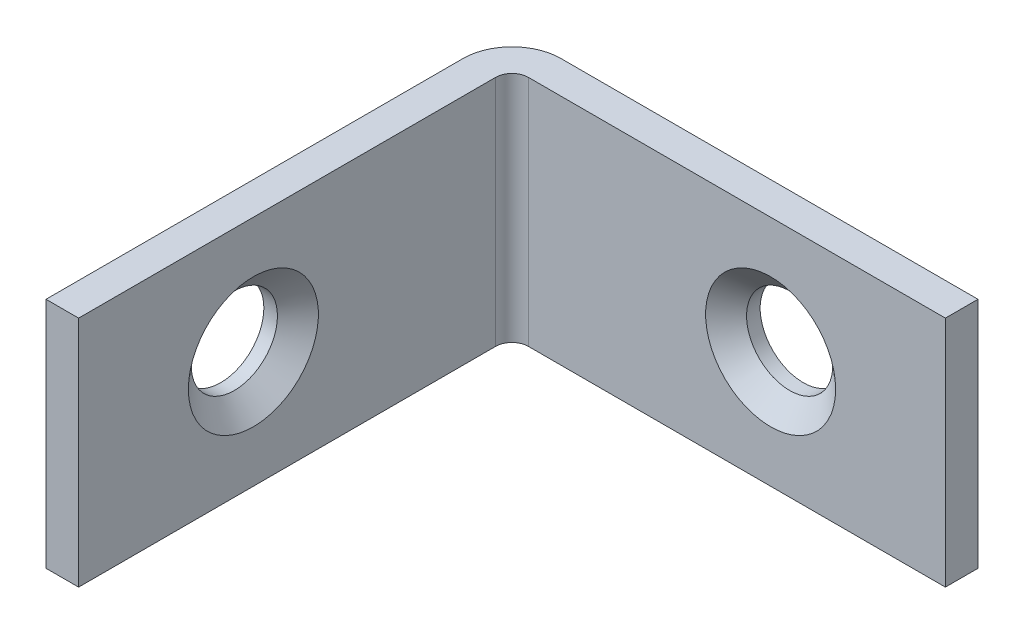
ISO-10303-21;
HEADER;
FILE_DESCRIPTION(('STEP AP214'),'2;1');
FILE_NAME('part.step','',(''),(''),'','','');
FILE_SCHEMA(('AUTOMOTIVE_DESIGN { 1 0 10303 214 1 1 1 1 }'));
ENDSEC;
DATA;
#1=APPLICATION_CONTEXT('core data for automotive mechanical design processes');
#2=APPLICATION_PROTOCOL_DEFINITION('international standard','automotive_design',2000,#1);
#3=PRODUCT_CONTEXT('',#1,'mechanical');
#4=PRODUCT('Part','Part','',(#3));
#5=PRODUCT_RELATED_PRODUCT_CATEGORY('part','',(#4));
#6=PRODUCT_DEFINITION_FORMATION('','',#4);
#7=PRODUCT_DEFINITION_CONTEXT('part definition',#1,'design');
#8=PRODUCT_DEFINITION('design','',#6,#7);
#9=PRODUCT_DEFINITION_SHAPE('','',#8);
#10=(LENGTH_UNIT() NAMED_UNIT(*) SI_UNIT(.MILLI.,.METRE.));
#11=(NAMED_UNIT(*) PLANE_ANGLE_UNIT() SI_UNIT($,.RADIAN.));
#12=(NAMED_UNIT(*) SI_UNIT($,.STERADIAN.) SOLID_ANGLE_UNIT());
#13=UNCERTAINTY_MEASURE_WITH_UNIT(LENGTH_MEASURE(1.E-05),#10,'distance_accuracy_value','');
#14=(GEOMETRIC_REPRESENTATION_CONTEXT(3) GLOBAL_UNCERTAINTY_ASSIGNED_CONTEXT((#13)) GLOBAL_UNIT_ASSIGNED_CONTEXT((#10,
#11,#12)) REPRESENTATION_CONTEXT('',''));
#15=CARTESIAN_POINT('',(0.,0.,0.));
#16=DIRECTION('',(0.,0.,1.));
#17=DIRECTION('',(1.,0.,0.));
#18=AXIS2_PLACEMENT_3D('',#15,#16,#17);
#19=CARTESIAN_POINT('',(2.667,6.35,1.778));
#20=DIRECTION('',(0.,0.,-1.));
#21=DIRECTION('',(-1.,0.,0.));
#22=AXIS2_PLACEMENT_3D('',#19,#20,#21);
#23=PLANE('',#22);
#24=CARTESIAN_POINT('',(15.875,0.,1.778));
#25=DIRECTION('',(0.,0.,1.));
#26=DIRECTION('',(1.,0.,0.));
#27=AXIS2_PLACEMENT_3D('',#24,#25,#26);
#28=CIRCLE('',#27,3.5433);
#29=CARTESIAN_POINT('',(19.4183,0.,1.778));
#30=VERTEX_POINT('',#29);
#31=EDGE_CURVE('E163',#30,#30,#28,.T.);
#32=ORIENTED_EDGE('',*,*,#31,.F.);
#33=EDGE_LOOP('',(#32));
#34=FACE_BOUND('',#33,.T.);
#35=DIRECTION('',(1.,0.,0.));
#36=VECTOR('',#35,1.);
#37=CARTESIAN_POINT('',(2.667,-6.35,1.778));
#38=LINE('',#37,#36);
#39=CARTESIAN_POINT('',(2.667,-6.35,1.778));
#40=VERTEX_POINT('',#39);
#41=CARTESIAN_POINT('',(25.4,-6.35,1.778));
#42=VERTEX_POINT('',#41);
#43=EDGE_CURVE('E135',#40,#42,#38,.T.);
#44=ORIENTED_EDGE('',*,*,#43,.T.);
#45=DIRECTION('',(0.,-1.,0.));
#46=VECTOR('',#45,1.);
#47=CARTESIAN_POINT('',(25.4,6.35,1.778));
#48=LINE('',#47,#46);
#49=CARTESIAN_POINT('',(25.4,6.35,1.778));
#50=VERTEX_POINT('',#49);
#51=EDGE_CURVE('E11',#50,#42,#48,.T.);
#52=ORIENTED_EDGE('',*,*,#51,.F.);
#53=DIRECTION('',(1.,0.,0.));
#54=VECTOR('',#53,1.);
#55=CARTESIAN_POINT('',(2.667,6.35,1.778));
#56=LINE('',#55,#54);
#57=CARTESIAN_POINT('',(2.667,6.35,1.778));
#58=VERTEX_POINT('',#57);
#59=EDGE_CURVE('E93',#58,#50,#56,.T.);
#60=ORIENTED_EDGE('',*,*,#59,.F.);
#61=DIRECTION('',(0.,-1.,0.));
#62=VECTOR('',#61,1.);
#63=CARTESIAN_POINT('',(2.667,6.35,1.778));
#64=LINE('',#63,#62);
#65=EDGE_CURVE('E134',#58,#40,#64,.T.);
#66=ORIENTED_EDGE('',*,*,#65,.T.);
#67=EDGE_LOOP('',(#44,#52,#60,#66));
#68=FACE_BOUND('',#67,.T.);
#69=ADVANCED_FACE('F36',(#34,#68),#23,.F.);
#70=CARTESIAN_POINT('',(25.4,6.35,0.));
#71=DIRECTION('',(1.,0.,0.));
#72=DIRECTION('',(0.,0.,-1.));
#73=AXIS2_PLACEMENT_3D('',#70,#71,#72);
#74=PLANE('',#73);
#75=DIRECTION('',(0.,0.,1.));
#76=VECTOR('',#75,1.);
#77=CARTESIAN_POINT('',(25.4,-6.35,0.));
#78=LINE('',#77,#76);
#79=CARTESIAN_POINT('',(25.4,-6.35,0.));
#80=VERTEX_POINT('',#79);
#81=EDGE_CURVE('E138',#80,#42,#78,.T.);
#82=ORIENTED_EDGE('',*,*,#81,.F.);
#83=DIRECTION('',(0.,-1.,0.));
#84=VECTOR('',#83,1.);
#85=CARTESIAN_POINT('',(25.4,6.35,0.));
#86=LINE('',#85,#84);
#87=CARTESIAN_POINT('',(25.4,6.35,0.));
#88=VERTEX_POINT('',#87);
#89=EDGE_CURVE('E45',#88,#80,#86,.T.);
#90=ORIENTED_EDGE('',*,*,#89,.F.);
#91=DIRECTION('',(0.,0.,1.));
#92=VECTOR('',#91,1.);
#93=CARTESIAN_POINT('',(25.4,6.35,0.));
#94=LINE('',#93,#92);
#95=EDGE_CURVE('E178',#88,#50,#94,.T.);
#96=ORIENTED_EDGE('',*,*,#95,.T.);
#97=ORIENTED_EDGE('',*,*,#51,.T.);
#98=EDGE_LOOP('',(#82,#90,#96,#97));
#99=FACE_BOUND('',#98,.T.);
#100=ADVANCED_FACE('F209',(#99),#74,.T.);
#101=CARTESIAN_POINT('',(2.667,6.35,0.));
#102=DIRECTION('',(0.,0.,-1.));
#103=DIRECTION('',(-1.,0.,0.));
#104=AXIS2_PLACEMENT_3D('',#101,#102,#103);
#105=PLANE('',#104);
#106=CARTESIAN_POINT('',(15.875,0.,0.));
#107=DIRECTION('',(0.,0.,1.));
#108=DIRECTION('',(1.,0.,0.));
#109=AXIS2_PLACEMENT_3D('',#106,#107,#108);
#110=CIRCLE('',#109,2.3495);
#111=CARTESIAN_POINT('',(18.2245,0.,0.));
#112=VERTEX_POINT('',#111);
#113=EDGE_CURVE('E139',#112,#112,#110,.T.);
#114=ORIENTED_EDGE('',*,*,#113,.T.);
#115=EDGE_LOOP('',(#114));
#116=FACE_BOUND('',#115,.T.);
#117=DIRECTION('',(1.,0.,0.));
#118=VECTOR('',#117,1.);
#119=CARTESIAN_POINT('',(2.667,-6.35,0.));
#120=LINE('',#119,#118);
#121=CARTESIAN_POINT('',(2.667,-6.35,0.));
#122=VERTEX_POINT('',#121);
#123=EDGE_CURVE('E142',#122,#80,#120,.T.);
#124=ORIENTED_EDGE('',*,*,#123,.F.);
#125=DIRECTION('',(0.,-1.,0.));
#126=VECTOR('',#125,1.);
#127=CARTESIAN_POINT('',(2.667,6.35,0.));
#128=LINE('',#127,#126);
#129=CARTESIAN_POINT('',(2.667,6.35,0.));
#130=VERTEX_POINT('',#129);
#131=EDGE_CURVE('E159',#130,#122,#128,.T.);
#132=ORIENTED_EDGE('',*,*,#131,.F.);
#133=DIRECTION('',(1.,0.,0.));
#134=VECTOR('',#133,1.);
#135=CARTESIAN_POINT('',(2.667,6.35,0.));
#136=LINE('',#135,#134);
#137=EDGE_CURVE('E181',#130,#88,#136,.T.);
#138=ORIENTED_EDGE('',*,*,#137,.T.);
#139=ORIENTED_EDGE('',*,*,#89,.T.);
#140=EDGE_LOOP('',(#124,#132,#138,#139));
#141=FACE_BOUND('',#140,.T.);
#142=ADVANCED_FACE('F214',(#116,#141),#105,.T.);
#143=CARTESIAN_POINT('',(2.667,6.35,2.667));
#144=DIRECTION('',(0.,-1.,0.));
#145=DIRECTION('',(0.,0.,-1.));
#146=AXIS2_PLACEMENT_3D('',#143,#144,#145);
#147=CYLINDRICAL_SURFACE('',#146,2.667);
#148=CARTESIAN_POINT('',(2.667,-6.35,2.667));
#149=DIRECTION('',(0.,-1.,0.));
#150=DIRECTION('',(0.,0.,1.));
#151=AXIS2_PLACEMENT_3D('',#148,#149,#150);
#152=CIRCLE('',#151,2.667);
#153=CARTESIAN_POINT('',(0.,-6.35,2.667));
#154=VERTEX_POINT('',#153);
#155=EDGE_CURVE('E145',#154,#122,#152,.T.);
#156=ORIENTED_EDGE('',*,*,#155,.F.);
#157=DIRECTION('',(0.,-1.,0.));
#158=VECTOR('',#157,1.);
#159=CARTESIAN_POINT('',(0.,6.35,2.667));
#160=LINE('',#159,#158);
#161=CARTESIAN_POINT('',(0.,6.35,2.667));
#162=VERTEX_POINT('',#161);
#163=EDGE_CURVE('E157',#162,#154,#160,.T.);
#164=ORIENTED_EDGE('',*,*,#163,.F.);
#165=CARTESIAN_POINT('',(2.667,6.35,2.667));
#166=DIRECTION('',(0.,-1.,0.));
#167=DIRECTION('',(0.,0.,1.));
#168=AXIS2_PLACEMENT_3D('',#165,#166,#167);
#169=CIRCLE('',#168,2.667);
#170=EDGE_CURVE('E129',#162,#130,#169,.T.);
#171=ORIENTED_EDGE('',*,*,#170,.T.);
#172=ORIENTED_EDGE('',*,*,#131,.T.);
#173=EDGE_LOOP('',(#156,#164,#171,#172));
#174=FACE_BOUND('',#173,.T.);
#175=ADVANCED_FACE('F186',(#174),#147,.T.);
#176=CARTESIAN_POINT('',(0.,6.35,25.4));
#177=DIRECTION('',(-1.,0.,0.));
#178=DIRECTION('',(0.,0.,1.));
#179=AXIS2_PLACEMENT_3D('',#176,#177,#178);
#180=PLANE('',#179);
#181=CARTESIAN_POINT('',(0.,0.,15.875));
#182=DIRECTION('',(1.,0.,0.));
#183=DIRECTION('',(0.,0.,1.));
#184=AXIS2_PLACEMENT_3D('',#181,#182,#183);
#185=CIRCLE('',#184,2.3495);
#186=CARTESIAN_POINT('',(0.,0.,18.2245));
#187=VERTEX_POINT('',#186);
#188=EDGE_CURVE('E169',#187,#187,#185,.T.);
#189=ORIENTED_EDGE('',*,*,#188,.T.);
#190=EDGE_LOOP('',(#189));
#191=FACE_BOUND('',#190,.T.);
#192=DIRECTION('',(0.,0.,-1.));
#193=VECTOR('',#192,1.);
#194=CARTESIAN_POINT('',(0.,-6.35,25.4));
#195=LINE('',#194,#193);
#196=CARTESIAN_POINT('',(0.,-6.35,25.4));
#197=VERTEX_POINT('',#196);
#198=EDGE_CURVE('E148',#197,#154,#195,.T.);
#199=ORIENTED_EDGE('',*,*,#198,.F.);
#200=DIRECTION('',(0.,-1.,0.));
#201=VECTOR('',#200,1.);
#202=CARTESIAN_POINT('',(0.,6.35,25.4));
#203=LINE('',#202,#201);
#204=CARTESIAN_POINT('',(0.,6.35,25.4));
#205=VERTEX_POINT('',#204);
#206=EDGE_CURVE('E117',#205,#197,#203,.T.);
#207=ORIENTED_EDGE('',*,*,#206,.F.);
#208=DIRECTION('',(0.,0.,-1.));
#209=VECTOR('',#208,1.);
#210=CARTESIAN_POINT('',(0.,6.35,25.4));
#211=LINE('',#210,#209);
#212=EDGE_CURVE('E127',#205,#162,#211,.T.);
#213=ORIENTED_EDGE('',*,*,#212,.T.);
#214=ORIENTED_EDGE('',*,*,#163,.T.);
#215=EDGE_LOOP('',(#199,#207,#213,#214));
#216=FACE_BOUND('',#215,.T.);
#217=ADVANCED_FACE('F191',(#191,#216),#180,.T.);
#218=CARTESIAN_POINT('',(1.778,6.35,25.4));
#219=DIRECTION('',(0.,0.,1.));
#220=DIRECTION('',(1.,0.,0.));
#221=AXIS2_PLACEMENT_3D('',#218,#219,#220);
#222=PLANE('',#221);
#223=DIRECTION('',(-1.,0.,0.));
#224=VECTOR('',#223,1.);
#225=CARTESIAN_POINT('',(1.778,-6.35,25.4));
#226=LINE('',#225,#224);
#227=CARTESIAN_POINT('',(1.778,-6.35,25.4));
#228=VERTEX_POINT('',#227);
#229=EDGE_CURVE('E116',#228,#197,#226,.T.);
#230=ORIENTED_EDGE('',*,*,#229,.F.);
#231=DIRECTION('',(0.,-1.,0.));
#232=VECTOR('',#231,1.);
#233=CARTESIAN_POINT('',(1.778,6.35,25.4));
#234=LINE('',#233,#232);
#235=CARTESIAN_POINT('',(1.778,6.35,25.4));
#236=VERTEX_POINT('',#235);
#237=EDGE_CURVE('E110',#236,#228,#234,.T.);
#238=ORIENTED_EDGE('',*,*,#237,.F.);
#239=DIRECTION('',(-1.,0.,0.));
#240=VECTOR('',#239,1.);
#241=CARTESIAN_POINT('',(1.778,6.35,25.4));
#242=LINE('',#241,#240);
#243=EDGE_CURVE('E114',#236,#205,#242,.T.);
#244=ORIENTED_EDGE('',*,*,#243,.T.);
#245=ORIENTED_EDGE('',*,*,#206,.T.);
#246=EDGE_LOOP('',(#230,#238,#244,#245));
#247=FACE_BOUND('',#246,.T.);
#248=ADVANCED_FACE('F112',(#247),#222,.T.);
#249=CARTESIAN_POINT('',(1.778,6.35,25.4));
#250=DIRECTION('',(-1.,0.,0.));
#251=DIRECTION('',(0.,0.,1.));
#252=AXIS2_PLACEMENT_3D('',#249,#250,#251);
#253=PLANE('',#252);
#254=CARTESIAN_POINT('',(1.77799999999995,0.,15.875));
#255=DIRECTION('',(1.,0.,0.));
#256=DIRECTION('',(0.,0.,1.));
#257=AXIS2_PLACEMENT_3D('',#254,#255,#256);
#258=CIRCLE('',#257,3.5433);
#259=CARTESIAN_POINT('',(1.77799999999994,0.,19.4183));
#260=VERTEX_POINT('',#259);
#261=EDGE_CURVE('E312',#260,#260,#258,.T.);
#262=ORIENTED_EDGE('',*,*,#261,.F.);
#263=EDGE_LOOP('',(#262));
#264=FACE_BOUND('',#263,.T.);
#265=DIRECTION('',(0.,0.,-1.));
#266=VECTOR('',#265,1.);
#267=CARTESIAN_POINT('',(1.778,-6.35,25.4));
#268=LINE('',#267,#266);
#269=CARTESIAN_POINT('',(1.778,-6.35,2.667));
#270=VERTEX_POINT('',#269);
#271=EDGE_CURVE('E81',#228,#270,#268,.T.);
#272=ORIENTED_EDGE('',*,*,#271,.T.);
#273=DIRECTION('',(0.,-1.,0.));
#274=VECTOR('',#273,1.);
#275=CARTESIAN_POINT('',(1.778,6.35,2.667));
#276=LINE('',#275,#274);
#277=CARTESIAN_POINT('',(1.778,6.35,2.667));
#278=VERTEX_POINT('',#277);
#279=EDGE_CURVE('E118',#278,#270,#276,.T.);
#280=ORIENTED_EDGE('',*,*,#279,.F.);
#281=DIRECTION('',(0.,0.,-1.));
#282=VECTOR('',#281,1.);
#283=CARTESIAN_POINT('',(1.778,6.35,25.4));
#284=LINE('',#283,#282);
#285=EDGE_CURVE('E120',#236,#278,#284,.T.);
#286=ORIENTED_EDGE('',*,*,#285,.F.);
#287=ORIENTED_EDGE('',*,*,#237,.T.);
#288=EDGE_LOOP('',(#272,#280,#286,#287));
#289=FACE_BOUND('',#288,.T.);
#290=ADVANCED_FACE('F121',(#264,#289),#253,.F.);
#291=CARTESIAN_POINT('',(2.667,6.35,2.667));
#292=DIRECTION('',(0.,-1.,0.));
#293=DIRECTION('',(0.,0.,-1.));
#294=AXIS2_PLACEMENT_3D('',#291,#292,#293);
#295=CYLINDRICAL_SURFACE('',#294,0.889);
#296=CARTESIAN_POINT('',(2.667,-6.35,2.667));
#297=DIRECTION('',(0.,1.,0.));
#298=DIRECTION('',(1.,0.,0.));
#299=AXIS2_PLACEMENT_3D('',#296,#297,#298);
#300=CIRCLE('',#299,0.889);
#301=EDGE_CURVE('E87',#270,#40,#300,.F.);
#302=ORIENTED_EDGE('',*,*,#301,.T.);
#303=ORIENTED_EDGE('',*,*,#65,.F.);
#304=CARTESIAN_POINT('',(2.667,6.35,2.667));
#305=DIRECTION('',(0.,1.,0.));
#306=DIRECTION('',(1.,0.,0.));
#307=AXIS2_PLACEMENT_3D('',#304,#305,#306);
#308=CIRCLE('',#307,0.889);
#309=EDGE_CURVE('E54',#278,#58,#308,.F.);
#310=ORIENTED_EDGE('',*,*,#309,.F.);
#311=ORIENTED_EDGE('',*,*,#279,.T.);
#312=EDGE_LOOP('',(#302,#303,#310,#311));
#313=FACE_BOUND('',#312,.T.);
#314=ADVANCED_FACE('F197',(#313),#295,.F.);
#315=CARTESIAN_POINT('',(2.667,6.35,2.667));
#316=DIRECTION('',(0.,-1.,0.));
#317=DIRECTION('',(-1.,0.,0.));
#318=AXIS2_PLACEMENT_3D('',#315,#316,#317);
#319=PLANE('',#318);
#320=ORIENTED_EDGE('',*,*,#59,.T.);
#321=ORIENTED_EDGE('',*,*,#95,.F.);
#322=ORIENTED_EDGE('',*,*,#137,.F.);
#323=ORIENTED_EDGE('',*,*,#170,.F.);
#324=ORIENTED_EDGE('',*,*,#212,.F.);
#325=ORIENTED_EDGE('',*,*,#243,.F.);
#326=ORIENTED_EDGE('',*,*,#285,.T.);
#327=ORIENTED_EDGE('',*,*,#309,.T.);
#328=EDGE_LOOP('',(#320,#321,#322,#323,#324,#325,#326,#327));
#329=FACE_BOUND('',#328,.T.);
#330=ADVANCED_FACE('F124',(#329),#319,.F.);
#331=CARTESIAN_POINT('',(2.667,-6.35,2.667));
#332=DIRECTION('',(0.,-1.,0.));
#333=DIRECTION('',(-1.,0.,0.));
#334=AXIS2_PLACEMENT_3D('',#331,#332,#333);
#335=PLANE('',#334);
#336=ORIENTED_EDGE('',*,*,#43,.F.);
#337=ORIENTED_EDGE('',*,*,#301,.F.);
#338=ORIENTED_EDGE('',*,*,#271,.F.);
#339=ORIENTED_EDGE('',*,*,#229,.T.);
#340=ORIENTED_EDGE('',*,*,#198,.T.);
#341=ORIENTED_EDGE('',*,*,#155,.T.);
#342=ORIENTED_EDGE('',*,*,#123,.T.);
#343=ORIENTED_EDGE('',*,*,#81,.T.);
#344=EDGE_LOOP('',(#336,#337,#338,#339,#340,#341,#342,#343));
#345=FACE_BOUND('',#344,.T.);
#346=ADVANCED_FACE('F194',(#345),#335,.T.);
#347=CARTESIAN_POINT('',(15.875,0.,0.));
#348=DIRECTION('',(0.,0.,1.));
#349=DIRECTION('',(1.,0.,0.));
#350=AXIS2_PLACEMENT_3D('',#347,#348,#349);
#351=CYLINDRICAL_SURFACE('',#350,2.3495);
#352=CARTESIAN_POINT('',(15.875,0.,0.740245492394996));
#353=DIRECTION('',(0.,0.,1.));
#354=DIRECTION('',(1.,0.,0.));
#355=AXIS2_PLACEMENT_3D('',#352,#353,#354);
#356=CIRCLE('',#355,2.3495);
#357=CARTESIAN_POINT('',(18.2245,0.,0.740245492394996));
#358=VERTEX_POINT('',#357);
#359=EDGE_CURVE('E161',#358,#358,#356,.T.);
#360=ORIENTED_EDGE('',*,*,#359,.T.);
#361=EDGE_LOOP('',(#360));
#362=FACE_BOUND('',#361,.T.);
#363=ORIENTED_EDGE('',*,*,#113,.F.);
#364=EDGE_LOOP('',(#363));
#365=FACE_BOUND('',#364,.T.);
#366=ADVANCED_FACE('F254',(#362,#365),#351,.F.);
#367=CARTESIAN_POINT('',(15.875,0.,1.778));
#368=DIRECTION('',(0.,0.,1.));
#369=DIRECTION('',(1.,0.,0.));
#370=AXIS2_PLACEMENT_3D('',#367,#368,#369);
#371=CONICAL_SURFACE('',#370,3.5433,0.855211333477223);
#372=ORIENTED_EDGE('',*,*,#31,.T.);
#373=EDGE_LOOP('',(#372));
#374=FACE_BOUND('',#373,.T.);
#375=ORIENTED_EDGE('',*,*,#359,.F.);
#376=EDGE_LOOP('',(#375));
#377=FACE_BOUND('',#376,.T.);
#378=ADVANCED_FACE('F259',(#374,#377),#371,.F.);
#379=CARTESIAN_POINT('',(0.,0.,15.875));
#380=DIRECTION('',(1.,0.,0.));
#381=DIRECTION('',(0.,0.,-1.));
#382=AXIS2_PLACEMENT_3D('',#379,#380,#381);
#383=CYLINDRICAL_SURFACE('',#382,2.3495);
#384=CARTESIAN_POINT('',(0.740245492394948,0.,15.875));
#385=DIRECTION('',(1.,0.,0.));
#386=DIRECTION('',(0.,0.,-1.));
#387=AXIS2_PLACEMENT_3D('',#384,#385,#386);
#388=CIRCLE('',#387,2.3495);
#389=CARTESIAN_POINT('',(0.740245492394957,0.,13.5255));
#390=VERTEX_POINT('',#389);
#391=EDGE_CURVE('E39',#390,#390,#388,.T.);
#392=ORIENTED_EDGE('',*,*,#391,.T.);
#393=EDGE_LOOP('',(#392));
#394=FACE_BOUND('',#393,.T.);
#395=ORIENTED_EDGE('',*,*,#188,.F.);
#396=EDGE_LOOP('',(#395));
#397=FACE_BOUND('',#396,.T.);
#398=ADVANCED_FACE('F269',(#394,#397),#383,.F.);
#399=CARTESIAN_POINT('',(1.77799999999995,0.,15.875));
#400=DIRECTION('',(1.,0.,0.));
#401=DIRECTION('',(0.,0.,1.));
#402=AXIS2_PLACEMENT_3D('',#399,#400,#401);
#403=CONICAL_SURFACE('',#402,3.5433,0.855211333477223);
#404=ORIENTED_EDGE('',*,*,#261,.T.);
#405=EDGE_LOOP('',(#404));
#406=FACE_BOUND('',#405,.T.);
#407=ORIENTED_EDGE('',*,*,#391,.F.);
#408=EDGE_LOOP('',(#407));
#409=FACE_BOUND('',#408,.T.);
#410=ADVANCED_FACE('F303',(#406,#409),#403,.F.);
#411=CLOSED_SHELL('',(#69,#100,#142,#175,#217,#248,#290,#314,#330,#346,#366,#378,#398,#410));
#412=MANIFOLD_SOLID_BREP('B2',#411);
#413=ADVANCED_BREP_SHAPE_REPRESENTATION('',(#18,#412),#14);
#414=SHAPE_DEFINITION_REPRESENTATION(#9,#413);
ENDSEC;
END-ISO-10303-21;
